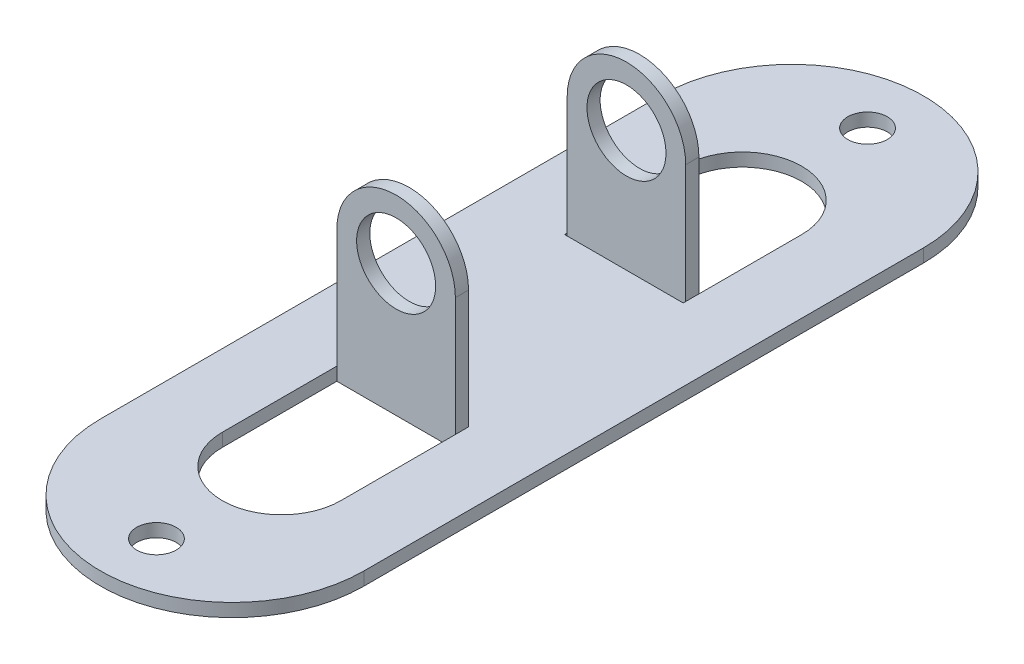
ISO-10303-21;
HEADER;
FILE_DESCRIPTION(('STEP AP214'),'2;1');
FILE_NAME('part.step','',(''),(''),'','','');
FILE_SCHEMA(('AUTOMOTIVE_DESIGN { 1 0 10303 214 1 1 1 1 }'));
ENDSEC;
DATA;
#1=APPLICATION_CONTEXT('core data for automotive mechanical design processes');
#2=APPLICATION_PROTOCOL_DEFINITION('international standard','automotive_design',2000,#1);
#3=PRODUCT_CONTEXT('',#1,'mechanical');
#4=PRODUCT('Part','Part','',(#3));
#5=PRODUCT_RELATED_PRODUCT_CATEGORY('part','',(#4));
#6=PRODUCT_DEFINITION_FORMATION('','',#4);
#7=PRODUCT_DEFINITION_CONTEXT('part definition',#1,'design');
#8=PRODUCT_DEFINITION('design','',#6,#7);
#9=PRODUCT_DEFINITION_SHAPE('','',#8);
#10=(LENGTH_UNIT() NAMED_UNIT(*) SI_UNIT(.MILLI.,.METRE.));
#11=(NAMED_UNIT(*) PLANE_ANGLE_UNIT() SI_UNIT($,.RADIAN.));
#12=(NAMED_UNIT(*) SI_UNIT($,.STERADIAN.) SOLID_ANGLE_UNIT());
#13=UNCERTAINTY_MEASURE_WITH_UNIT(LENGTH_MEASURE(1.E-05),#10,'distance_accuracy_value','');
#14=(GEOMETRIC_REPRESENTATION_CONTEXT(3) GLOBAL_UNCERTAINTY_ASSIGNED_CONTEXT((#13)) GLOBAL_UNIT_ASSIGNED_CONTEXT((#10,
#11,#12)) REPRESENTATION_CONTEXT('',''));
#15=CARTESIAN_POINT('',(0.,0.,0.));
#16=DIRECTION('',(0.,0.,1.));
#17=DIRECTION('',(1.,0.,0.));
#18=AXIS2_PLACEMENT_3D('',#15,#16,#17);
#19=CARTESIAN_POINT('',(9.,-10.,-1.59991843827286));
#20=DIRECTION('',(1.,0.,0.));
#21=DIRECTION('',(0.,0.,-1.));
#22=AXIS2_PLACEMENT_3D('',#19,#20,#21);
#23=PLANE('',#22);
#24=DIRECTION('',(0.,1.,0.));
#25=VECTOR('',#24,1.);
#26=CARTESIAN_POINT('',(9.,-2.,-3.985));
#27=LINE('',#26,#25);
#28=CARTESIAN_POINT('',(9.,-2.,-3.985));
#29=VERTEX_POINT('',#28);
#30=CARTESIAN_POINT('',(9.,0.,-3.985));
#31=VERTEX_POINT('',#30);
#32=EDGE_CURVE('E182',#29,#31,#27,.T.);
#33=ORIENTED_EDGE('',*,*,#32,.T.);
#34=DIRECTION('',(0.,0.,-1.));
#35=VECTOR('',#34,1.);
#36=CARTESIAN_POINT('',(9.,0.,-1.59991843827286));
#37=LINE('',#36,#35);
#38=CARTESIAN_POINT('',(9.,0.,-19.5999184382729));
#39=VERTEX_POINT('',#38);
#40=EDGE_CURVE('E359',#31,#39,#37,.T.);
#41=ORIENTED_EDGE('',*,*,#40,.T.);
#42=DIRECTION('',(0.,1.,0.));
#43=VECTOR('',#42,1.);
#44=CARTESIAN_POINT('',(9.,-10.,-19.5999184382729));
#45=LINE('',#44,#43);
#46=CARTESIAN_POINT('',(9.,-2.,-19.5999184382729));
#47=VERTEX_POINT('',#46);
#48=EDGE_CURVE('E205',#47,#39,#45,.T.);
#49=ORIENTED_EDGE('',*,*,#48,.F.);
#50=DIRECTION('',(0.,0.,-1.));
#51=VECTOR('',#50,1.);
#52=CARTESIAN_POINT('',(9.,-2.,-27.0999184382729));
#53=LINE('',#52,#51);
#54=EDGE_CURVE('E198',#29,#47,#53,.T.);
#55=ORIENTED_EDGE('',*,*,#54,.F.);
#56=EDGE_LOOP('',(#33,#41,#49,#55));
#57=FACE_BOUND('',#56,.T.);
#58=ADVANCED_FACE('F38',(#57),#23,.F.);
#59=CARTESIAN_POINT('',(-9.,-10.,-1.59991843827286));
#60=DIRECTION('',(-1.,0.,0.));
#61=DIRECTION('',(0.,0.,1.));
#62=AXIS2_PLACEMENT_3D('',#59,#60,#61);
#63=PLANE('',#62);
#64=DIRECTION('',(0.,1.,0.));
#65=VECTOR('',#64,1.);
#66=CARTESIAN_POINT('',(-9.,-10.,-3.985));
#67=LINE('',#66,#65);
#68=CARTESIAN_POINT('',(-9.,-2.,-3.985));
#69=VERTEX_POINT('',#68);
#70=CARTESIAN_POINT('',(-9.,0.,-3.985));
#71=VERTEX_POINT('',#70);
#72=EDGE_CURVE('E11',#69,#71,#67,.T.);
#73=ORIENTED_EDGE('',*,*,#72,.F.);
#74=DIRECTION('',(0.,0.,1.));
#75=VECTOR('',#74,1.);
#76=CARTESIAN_POINT('',(-9.,-2.,-27.0999184382729));
#77=LINE('',#76,#75);
#78=CARTESIAN_POINT('',(-9.,-2.,-19.5999184382729));
#79=VERTEX_POINT('',#78);
#80=EDGE_CURVE('E201',#79,#69,#77,.T.);
#81=ORIENTED_EDGE('',*,*,#80,.F.);
#82=DIRECTION('',(0.,1.,0.));
#83=VECTOR('',#82,1.);
#84=CARTESIAN_POINT('',(-9.,-10.,-19.5999184382729));
#85=LINE('',#84,#83);
#86=CARTESIAN_POINT('',(-9.,0.,-19.5999184382729));
#87=VERTEX_POINT('',#86);
#88=EDGE_CURVE('E279',#79,#87,#85,.T.);
#89=ORIENTED_EDGE('',*,*,#88,.T.);
#90=DIRECTION('',(0.,0.,1.));
#91=VECTOR('',#90,1.);
#92=CARTESIAN_POINT('',(-9.,0.,-1.59991843827286));
#93=LINE('',#92,#91);
#94=EDGE_CURVE('E271',#87,#71,#93,.T.);
#95=ORIENTED_EDGE('',*,*,#94,.T.);
#96=EDGE_LOOP('',(#73,#81,#89,#95));
#97=FACE_BOUND('',#96,.T.);
#98=ADVANCED_FACE('F364',(#97),#63,.F.);
#99=CARTESIAN_POINT('',(0.,0.,-27.0999184382729));
#100=DIRECTION('',(0.,1.,0.));
#101=DIRECTION('',(0.,0.,1.));
#102=AXIS2_PLACEMENT_3D('',#99,#100,#101);
#103=PLANE('',#102);
#104=CARTESIAN_POINT('',(0.,0.,-38.5999184382729));
#105=DIRECTION('',(0.,1.,0.));
#106=DIRECTION('',(0.,0.,1.));
#107=AXIS2_PLACEMENT_3D('',#104,#105,#106);
#108=CIRCLE('',#107,3.);
#109=CARTESIAN_POINT('',(0.,0.,-35.5999184382729));
#110=VERTEX_POINT('',#109);
#111=EDGE_CURVE('E387',#110,#110,#108,.T.);
#112=ORIENTED_EDGE('',*,*,#111,.F.);
#113=EDGE_LOOP('',(#112));
#114=FACE_BOUND('',#113,.T.);
#115=CARTESIAN_POINT('',(0.,0.,69.4000815617271));
#116=DIRECTION('',(0.,1.,0.));
#117=DIRECTION('',(0.,0.,1.));
#118=AXIS2_PLACEMENT_3D('',#115,#116,#117);
#119=CIRCLE('',#118,3.);
#120=CARTESIAN_POINT('',(0.,0.,72.4000815617271));
#121=VERTEX_POINT('',#120);
#122=EDGE_CURVE('E381',#121,#121,#119,.T.);
#123=ORIENTED_EDGE('',*,*,#122,.F.);
#124=EDGE_LOOP('',(#123));
#125=FACE_BOUND('',#124,.T.);
#126=CARTESIAN_POINT('',(9.,0.,-1.59991843827286));
#127=VERTEX_POINT('',#126);
#128=CARTESIAN_POINT('',(9.,0.,-1.985));
#129=VERTEX_POINT('',#128);
#130=EDGE_CURVE('E273',#127,#129,#37,.T.);
#131=ORIENTED_EDGE('',*,*,#130,.F.);
#132=DIRECTION('',(1.,0.,0.));
#133=VECTOR('',#132,1.);
#134=CARTESIAN_POINT('',(9.,0.,-1.59991843827286));
#135=LINE('',#134,#133);
#136=CARTESIAN_POINT('',(-9.,0.,-1.59991843827286));
#137=VERTEX_POINT('',#136);
#138=EDGE_CURVE('E268',#137,#127,#135,.T.);
#139=ORIENTED_EDGE('',*,*,#138,.F.);
#140=CARTESIAN_POINT('',(-9.,0.,-1.985));
#141=VERTEX_POINT('',#140);
#142=EDGE_CURVE('E255',#141,#137,#93,.T.);
#143=ORIENTED_EDGE('',*,*,#142,.F.);
#144=EDGE_CURVE('E265',#71,#141,#93,.T.);
#145=ORIENTED_EDGE('',*,*,#144,.F.);
#146=ORIENTED_EDGE('',*,*,#94,.F.);
#147=CARTESIAN_POINT('',(0.,0.,-19.5999184382729));
#148=DIRECTION('',(0.,1.,0.));
#149=DIRECTION('',(0.,0.,-1.));
#150=AXIS2_PLACEMENT_3D('',#147,#148,#149);
#151=CIRCLE('',#150,9.);
#152=EDGE_CURVE('E269',#39,#87,#151,.T.);
#153=ORIENTED_EDGE('',*,*,#152,.F.);
#154=ORIENTED_EDGE('',*,*,#40,.F.);
#155=EDGE_CURVE('E360',#129,#31,#37,.T.);
#156=ORIENTED_EDGE('',*,*,#155,.F.);
#157=EDGE_LOOP('',(#131,#139,#143,#145,#146,#153,#154,#156));
#158=FACE_BOUND('',#157,.T.);
#159=CARTESIAN_POINT('',(0.,0.,-27.0999184382729));
#160=DIRECTION('',(0.,1.,0.));
#161=DIRECTION('',(0.,0.,1.));
#162=AXIS2_PLACEMENT_3D('',#159,#160,#161);
#163=CIRCLE('',#162,20.);
#164=CARTESIAN_POINT('',(20.,0.,-27.0999184382729));
#165=VERTEX_POINT('',#164);
#166=CARTESIAN_POINT('',(-20.,0.,-27.0999184382729));
#167=VERTEX_POINT('',#166);
#168=EDGE_CURVE('E210',#165,#167,#163,.T.);
#169=ORIENTED_EDGE('',*,*,#168,.T.);
#170=DIRECTION('',(0.,0.,1.));
#171=VECTOR('',#170,1.);
#172=CARTESIAN_POINT('',(-20.,0.,-27.0999184382729));
#173=LINE('',#172,#171);
#174=CARTESIAN_POINT('',(-20.,0.,57.9000815617271));
#175=VERTEX_POINT('',#174);
#176=EDGE_CURVE('E231',#167,#175,#173,.T.);
#177=ORIENTED_EDGE('',*,*,#176,.T.);
#178=CARTESIAN_POINT('',(0.,0.,57.9000815617271));
#179=DIRECTION('',(0.,1.,0.));
#180=DIRECTION('',(0.,0.,1.));
#181=AXIS2_PLACEMENT_3D('',#178,#179,#180);
#182=CIRCLE('',#181,20.);
#183=CARTESIAN_POINT('',(20.,0.,57.9000815617271));
#184=VERTEX_POINT('',#183);
#185=EDGE_CURVE('E234',#175,#184,#182,.T.);
#186=ORIENTED_EDGE('',*,*,#185,.T.);
#187=DIRECTION('',(0.,0.,-1.));
#188=VECTOR('',#187,1.);
#189=CARTESIAN_POINT('',(20.,0.,-27.0999184382729));
#190=LINE('',#189,#188);
#191=EDGE_CURVE('E219',#184,#165,#190,.T.);
#192=ORIENTED_EDGE('',*,*,#191,.T.);
#193=EDGE_LOOP('',(#169,#177,#186,#192));
#194=FACE_BOUND('',#193,.T.);
#195=DIRECTION('',(1.,0.,0.));
#196=VECTOR('',#195,1.);
#197=CARTESIAN_POINT('',(0.,0.,31.));
#198=LINE('',#197,#196);
#199=CARTESIAN_POINT('',(-8.99999999999999,0.,31.));
#200=VERTEX_POINT('',#199);
#201=CARTESIAN_POINT('',(9.00000000000001,0.,31.));
#202=VERTEX_POINT('',#201);
#203=EDGE_CURVE('E241',#200,#202,#198,.T.);
#204=ORIENTED_EDGE('',*,*,#203,.T.);
#205=DIRECTION('',(0.,0.,-1.));
#206=VECTOR('',#205,1.);
#207=CARTESIAN_POINT('',(9.00000000000001,0.,32.4000815617271));
#208=LINE('',#207,#206);
#209=CARTESIAN_POINT('',(9.00000000000001,0.,33.));
#210=VERTEX_POINT('',#209);
#211=EDGE_CURVE('E342',#210,#202,#208,.T.);
#212=ORIENTED_EDGE('',*,*,#211,.F.);
#213=CARTESIAN_POINT('',(9.00000000000001,0.,50.4000815617271));
#214=VERTEX_POINT('',#213);
#215=EDGE_CURVE('E343',#214,#210,#208,.T.);
#216=ORIENTED_EDGE('',*,*,#215,.F.);
#217=CARTESIAN_POINT('',(0.,0.,50.4000815617271));
#218=DIRECTION('',(0.,1.,0.));
#219=DIRECTION('',(0.,0.,-1.));
#220=AXIS2_PLACEMENT_3D('',#217,#218,#219);
#221=CIRCLE('',#220,9.);
#222=CARTESIAN_POINT('',(-8.99999999999999,0.,50.4000815617271));
#223=VERTEX_POINT('',#222);
#224=EDGE_CURVE('E339',#223,#214,#221,.T.);
#225=ORIENTED_EDGE('',*,*,#224,.F.);
#226=DIRECTION('',(0.,0.,1.));
#227=VECTOR('',#226,1.);
#228=CARTESIAN_POINT('',(-8.99999999999999,0.,32.4000815617271));
#229=LINE('',#228,#227);
#230=CARTESIAN_POINT('',(-8.99999999999999,0.,33.));
#231=VERTEX_POINT('',#230);
#232=EDGE_CURVE('E336',#231,#223,#229,.T.);
#233=ORIENTED_EDGE('',*,*,#232,.F.);
#234=EDGE_CURVE('E337',#200,#231,#229,.T.);
#235=ORIENTED_EDGE('',*,*,#234,.F.);
#236=EDGE_LOOP('',(#204,#212,#216,#225,#233,#235));
#237=FACE_BOUND('',#236,.T.);
#238=ADVANCED_FACE('F262',(#114,#125,#158,#194,#237),#103,.T.);
#239=CARTESIAN_POINT('',(0.,-2.,-27.0999184382729));
#240=DIRECTION('',(0.,1.,0.));
#241=DIRECTION('',(0.,0.,1.));
#242=AXIS2_PLACEMENT_3D('',#239,#240,#241);
#243=CYLINDRICAL_SURFACE('',#242,20.);
#244=ORIENTED_EDGE('',*,*,#168,.F.);
#245=DIRECTION('',(0.,1.,0.));
#246=VECTOR('',#245,1.);
#247=CARTESIAN_POINT('',(20.,-2.,-27.0999184382729));
#248=LINE('',#247,#246);
#249=CARTESIAN_POINT('',(20.,-2.,-27.0999184382729));
#250=VERTEX_POINT('',#249);
#251=EDGE_CURVE('E239',#250,#165,#248,.T.);
#252=ORIENTED_EDGE('',*,*,#251,.F.);
#253=CARTESIAN_POINT('',(0.,-2.,-27.0999184382729));
#254=DIRECTION('',(0.,1.,0.));
#255=DIRECTION('',(0.,0.,1.));
#256=AXIS2_PLACEMENT_3D('',#253,#254,#255);
#257=CIRCLE('',#256,20.);
#258=CARTESIAN_POINT('',(-20.,-2.,-27.0999184382729));
#259=VERTEX_POINT('',#258);
#260=EDGE_CURVE('E215',#250,#259,#257,.T.);
#261=ORIENTED_EDGE('',*,*,#260,.T.);
#262=DIRECTION('',(0.,1.,0.));
#263=VECTOR('',#262,1.);
#264=CARTESIAN_POINT('',(-20.,-2.,-27.0999184382729));
#265=LINE('',#264,#263);
#266=EDGE_CURVE('E228',#259,#167,#265,.T.);
#267=ORIENTED_EDGE('',*,*,#266,.T.);
#268=EDGE_LOOP('',(#244,#252,#261,#267));
#269=FACE_BOUND('',#268,.T.);
#270=ADVANCED_FACE('F40',(#269),#243,.T.);
#271=CARTESIAN_POINT('',(20.,-2.,-27.0999184382729));
#272=DIRECTION('',(1.,0.,0.));
#273=DIRECTION('',(0.,0.,-1.));
#274=AXIS2_PLACEMENT_3D('',#271,#272,#273);
#275=PLANE('',#274);
#276=ORIENTED_EDGE('',*,*,#191,.F.);
#277=DIRECTION('',(0.,1.,0.));
#278=VECTOR('',#277,1.);
#279=CARTESIAN_POINT('',(20.,-2.,57.9000815617271));
#280=LINE('',#279,#278);
#281=CARTESIAN_POINT('',(20.,-2.,57.9000815617271));
#282=VERTEX_POINT('',#281);
#283=EDGE_CURVE('E242',#282,#184,#280,.T.);
#284=ORIENTED_EDGE('',*,*,#283,.F.);
#285=DIRECTION('',(0.,0.,-1.));
#286=VECTOR('',#285,1.);
#287=CARTESIAN_POINT('',(20.,-2.,-27.0999184382729));
#288=LINE('',#287,#286);
#289=EDGE_CURVE('E225',#282,#250,#288,.T.);
#290=ORIENTED_EDGE('',*,*,#289,.T.);
#291=ORIENTED_EDGE('',*,*,#251,.T.);
#292=EDGE_LOOP('',(#276,#284,#290,#291));
#293=FACE_BOUND('',#292,.T.);
#294=ADVANCED_FACE('F648',(#293),#275,.T.);
#295=CARTESIAN_POINT('',(0.,-2.,57.9000815617271));
#296=DIRECTION('',(0.,1.,0.));
#297=DIRECTION('',(0.,0.,1.));
#298=AXIS2_PLACEMENT_3D('',#295,#296,#297);
#299=CYLINDRICAL_SURFACE('',#298,20.);
#300=ORIENTED_EDGE('',*,*,#185,.F.);
#301=DIRECTION('',(0.,1.,0.));
#302=VECTOR('',#301,1.);
#303=CARTESIAN_POINT('',(-20.,-2.,57.9000815617271));
#304=LINE('',#303,#302);
#305=CARTESIAN_POINT('',(-20.,-2.,57.9000815617271));
#306=VERTEX_POINT('',#305);
#307=EDGE_CURVE('E244',#306,#175,#304,.T.);
#308=ORIENTED_EDGE('',*,*,#307,.F.);
#309=CARTESIAN_POINT('',(0.,-2.,57.9000815617271));
#310=DIRECTION('',(0.,1.,0.));
#311=DIRECTION('',(0.,0.,1.));
#312=AXIS2_PLACEMENT_3D('',#309,#310,#311);
#313=CIRCLE('',#312,20.);
#314=EDGE_CURVE('E222',#306,#282,#313,.T.);
#315=ORIENTED_EDGE('',*,*,#314,.T.);
#316=ORIENTED_EDGE('',*,*,#283,.T.);
#317=EDGE_LOOP('',(#300,#308,#315,#316));
#318=FACE_BOUND('',#317,.T.);
#319=ADVANCED_FACE('F641',(#318),#299,.T.);
#320=CARTESIAN_POINT('',(-20.,-2.,-27.0999184382729));
#321=DIRECTION('',(-1.,0.,0.));
#322=DIRECTION('',(0.,0.,1.));
#323=AXIS2_PLACEMENT_3D('',#320,#321,#322);
#324=PLANE('',#323);
#325=ORIENTED_EDGE('',*,*,#176,.F.);
#326=ORIENTED_EDGE('',*,*,#266,.F.);
#327=DIRECTION('',(0.,0.,1.));
#328=VECTOR('',#327,1.);
#329=CARTESIAN_POINT('',(-20.,-2.,-27.0999184382729));
#330=LINE('',#329,#328);
#331=EDGE_CURVE('E218',#259,#306,#330,.T.);
#332=ORIENTED_EDGE('',*,*,#331,.T.);
#333=ORIENTED_EDGE('',*,*,#307,.T.);
#334=EDGE_LOOP('',(#325,#326,#332,#333));
#335=FACE_BOUND('',#334,.T.);
#336=ADVANCED_FACE('F398',(#335),#324,.T.);
#337=CARTESIAN_POINT('',(0.,-2.,-27.0999184382729));
#338=DIRECTION('',(0.,1.,0.));
#339=DIRECTION('',(0.,0.,1.));
#340=AXIS2_PLACEMENT_3D('',#337,#338,#339);
#341=PLANE('',#340);
#342=CARTESIAN_POINT('',(0.,-2.,-38.5999184382729));
#343=DIRECTION('',(0.,-1.,0.));
#344=DIRECTION('',(0.,0.,-1.));
#345=AXIS2_PLACEMENT_3D('',#342,#343,#344);
#346=CIRCLE('',#345,3.);
#347=CARTESIAN_POINT('',(0.,-2.,-41.5999184382729));
#348=VERTEX_POINT('',#347);
#349=EDGE_CURVE('E390',#348,#348,#346,.T.);
#350=ORIENTED_EDGE('',*,*,#349,.F.);
#351=EDGE_LOOP('',(#350));
#352=FACE_BOUND('',#351,.T.);
#353=CARTESIAN_POINT('',(0.,-2.,69.4000815617271));
#354=DIRECTION('',(0.,-1.,0.));
#355=DIRECTION('',(0.,0.,-1.));
#356=AXIS2_PLACEMENT_3D('',#353,#354,#355);
#357=CIRCLE('',#356,3.);
#358=CARTESIAN_POINT('',(0.,-2.,66.4000815617271));
#359=VERTEX_POINT('',#358);
#360=EDGE_CURVE('E384',#359,#359,#357,.T.);
#361=ORIENTED_EDGE('',*,*,#360,.F.);
#362=EDGE_LOOP('',(#361));
#363=FACE_BOUND('',#362,.T.);
#364=CARTESIAN_POINT('',(9.,-2.,-1.59991843827286));
#365=VERTEX_POINT('',#364);
#366=CARTESIAN_POINT('',(9.,-2.,-1.985));
#367=VERTEX_POINT('',#366);
#368=EDGE_CURVE('E206',#365,#367,#53,.T.);
#369=ORIENTED_EDGE('',*,*,#368,.T.);
#370=DIRECTION('',(1.,0.,0.));
#371=VECTOR('',#370,1.);
#372=CARTESIAN_POINT('',(9.,-2.,-1.985));
#373=LINE('',#372,#371);
#374=CARTESIAN_POINT('',(-9.,-2.,-1.985));
#375=VERTEX_POINT('',#374);
#376=EDGE_CURVE('E54',#375,#367,#373,.T.);
#377=ORIENTED_EDGE('',*,*,#376,.F.);
#378=CARTESIAN_POINT('',(-9.,-2.,-1.59991843827286));
#379=VERTEX_POINT('',#378);
#380=EDGE_CURVE('E257',#375,#379,#77,.T.);
#381=ORIENTED_EDGE('',*,*,#380,.T.);
#382=DIRECTION('',(1.,0.,0.));
#383=VECTOR('',#382,1.);
#384=CARTESIAN_POINT('',(0.,-2.,-1.59991843827286));
#385=LINE('',#384,#383);
#386=EDGE_CURVE('E207',#379,#365,#385,.T.);
#387=ORIENTED_EDGE('',*,*,#386,.T.);
#388=EDGE_LOOP('',(#369,#377,#381,#387));
#389=FACE_BOUND('',#388,.T.);
#390=DIRECTION('',(1.,0.,0.));
#391=VECTOR('',#390,1.);
#392=CARTESIAN_POINT('',(-8.99999999999999,-2.,33.));
#393=LINE('',#392,#391);
#394=CARTESIAN_POINT('',(-8.99999999999999,-2.,33.));
#395=VERTEX_POINT('',#394);
#396=CARTESIAN_POINT('',(9.00000000000001,-2.,33.));
#397=VERTEX_POINT('',#396);
#398=EDGE_CURVE('E312',#395,#397,#393,.T.);
#399=ORIENTED_EDGE('',*,*,#398,.F.);
#400=DIRECTION('',(0.,0.,1.));
#401=VECTOR('',#400,1.);
#402=CARTESIAN_POINT('',(-8.99999999999999,-2.,-27.0999184382729));
#403=LINE('',#402,#401);
#404=CARTESIAN_POINT('',(-8.99999999999999,-2.,50.4000815617271));
#405=VERTEX_POINT('',#404);
#406=EDGE_CURVE('E357',#395,#405,#403,.T.);
#407=ORIENTED_EDGE('',*,*,#406,.T.);
#408=CARTESIAN_POINT('',(0.,-2.,50.4000815617271));
#409=DIRECTION('',(0.,1.,0.));
#410=DIRECTION('',(0.,0.,1.));
#411=AXIS2_PLACEMENT_3D('',#408,#409,#410);
#412=CIRCLE('',#411,9.);
#413=CARTESIAN_POINT('',(9.00000000000001,-2.,50.4000815617271));
#414=VERTEX_POINT('',#413);
#415=EDGE_CURVE('E349',#405,#414,#412,.T.);
#416=ORIENTED_EDGE('',*,*,#415,.T.);
#417=DIRECTION('',(0.,0.,-1.));
#418=VECTOR('',#417,1.);
#419=CARTESIAN_POINT('',(9.00000000000001,-2.,-27.0999184382729));
#420=LINE('',#419,#418);
#421=EDGE_CURVE('E354',#414,#397,#420,.T.);
#422=ORIENTED_EDGE('',*,*,#421,.T.);
#423=EDGE_LOOP('',(#399,#407,#416,#422));
#424=FACE_BOUND('',#423,.T.);
#425=ORIENTED_EDGE('',*,*,#260,.F.);
#426=ORIENTED_EDGE('',*,*,#289,.F.);
#427=ORIENTED_EDGE('',*,*,#314,.F.);
#428=ORIENTED_EDGE('',*,*,#331,.F.);
#429=EDGE_LOOP('',(#425,#426,#427,#428));
#430=FACE_BOUND('',#429,.T.);
#431=DIRECTION('',(1.,0.,0.));
#432=VECTOR('',#431,1.);
#433=CARTESIAN_POINT('',(9.,-2.,-3.985));
#434=LINE('',#433,#432);
#435=EDGE_CURVE('E185',#69,#29,#434,.T.);
#436=ORIENTED_EDGE('',*,*,#435,.T.);
#437=ORIENTED_EDGE('',*,*,#54,.T.);
#438=CARTESIAN_POINT('',(0.,-2.,-19.5999184382729));
#439=DIRECTION('',(0.,1.,0.));
#440=DIRECTION('',(0.,0.,1.));
#441=AXIS2_PLACEMENT_3D('',#438,#439,#440);
#442=CIRCLE('',#441,9.);
#443=EDGE_CURVE('E284',#47,#79,#442,.T.);
#444=ORIENTED_EDGE('',*,*,#443,.T.);
#445=ORIENTED_EDGE('',*,*,#80,.T.);
#446=EDGE_LOOP('',(#436,#437,#444,#445));
#447=FACE_BOUND('',#446,.T.);
#448=ADVANCED_FACE('F196',(#352,#363,#389,#424,#430,#447),#341,.F.);
#449=ORIENTED_EDGE('',*,*,#130,.T.);
#450=DIRECTION('',(0.,1.,0.));
#451=VECTOR('',#450,1.);
#452=CARTESIAN_POINT('',(9.,-2.,-1.985));
#453=LINE('',#452,#451);
#454=EDGE_CURVE('E295',#367,#129,#453,.T.);
#455=ORIENTED_EDGE('',*,*,#454,.F.);
#456=ORIENTED_EDGE('',*,*,#368,.F.);
#457=DIRECTION('',(0.,1.,0.));
#458=VECTOR('',#457,1.);
#459=CARTESIAN_POINT('',(9.,-10.,-1.59991843827286));
#460=LINE('',#459,#458);
#461=EDGE_CURVE('E282',#365,#127,#460,.T.);
#462=ORIENTED_EDGE('',*,*,#461,.T.);
#463=EDGE_LOOP('',(#449,#455,#456,#462));
#464=FACE_BOUND('',#463,.T.);
#465=ADVANCED_FACE('F294',(#464),#23,.F.);
#466=CARTESIAN_POINT('',(9.,-10.,-1.59991843827286));
#467=DIRECTION('',(0.,0.,1.));
#468=DIRECTION('',(1.,0.,0.));
#469=AXIS2_PLACEMENT_3D('',#466,#467,#468);
#470=PLANE('',#469);
#471=DIRECTION('',(0.,1.,0.));
#472=VECTOR('',#471,1.);
#473=CARTESIAN_POINT('',(-9.,-10.,-1.59991843827286));
#474=LINE('',#473,#472);
#475=EDGE_CURVE('E285',#379,#137,#474,.T.);
#476=ORIENTED_EDGE('',*,*,#475,.T.);
#477=ORIENTED_EDGE('',*,*,#138,.T.);
#478=ORIENTED_EDGE('',*,*,#461,.F.);
#479=ORIENTED_EDGE('',*,*,#386,.F.);
#480=EDGE_LOOP('',(#476,#477,#478,#479));
#481=FACE_BOUND('',#480,.T.);
#482=ADVANCED_FACE('F291',(#481),#470,.F.);
#483=ORIENTED_EDGE('',*,*,#380,.F.);
#484=DIRECTION('',(0.,1.,0.));
#485=VECTOR('',#484,1.);
#486=CARTESIAN_POINT('',(-9.,-10.,-1.985));
#487=LINE('',#486,#485);
#488=EDGE_CURVE('E47',#375,#141,#487,.T.);
#489=ORIENTED_EDGE('',*,*,#488,.T.);
#490=ORIENTED_EDGE('',*,*,#142,.T.);
#491=ORIENTED_EDGE('',*,*,#475,.F.);
#492=EDGE_LOOP('',(#483,#489,#490,#491));
#493=FACE_BOUND('',#492,.T.);
#494=ADVANCED_FACE('F253',(#493),#63,.F.);
#495=CARTESIAN_POINT('',(0.,-10.,-19.5999184382729));
#496=DIRECTION('',(0.,1.,0.));
#497=DIRECTION('',(0.,0.,1.));
#498=AXIS2_PLACEMENT_3D('',#495,#496,#497);
#499=CYLINDRICAL_SURFACE('',#498,9.);
#500=ORIENTED_EDGE('',*,*,#48,.T.);
#501=ORIENTED_EDGE('',*,*,#152,.T.);
#502=ORIENTED_EDGE('',*,*,#88,.F.);
#503=ORIENTED_EDGE('',*,*,#443,.F.);
#504=EDGE_LOOP('',(#500,#501,#502,#503));
#505=FACE_BOUND('',#504,.T.);
#506=ADVANCED_FACE('F363',(#505),#499,.F.);
#507=CARTESIAN_POINT('',(-8.99999999999999,-10.,32.4000815617271));
#508=DIRECTION('',(-1.,0.,0.));
#509=DIRECTION('',(0.,0.,1.));
#510=AXIS2_PLACEMENT_3D('',#507,#508,#509);
#511=PLANE('',#510);
#512=ORIENTED_EDGE('',*,*,#406,.F.);
#513=DIRECTION('',(0.,-1.,0.));
#514=VECTOR('',#513,1.);
#515=CARTESIAN_POINT('',(-8.99999999999999,-2.,33.));
#516=LINE('',#515,#514);
#517=EDGE_CURVE('E321',#231,#395,#516,.T.);
#518=ORIENTED_EDGE('',*,*,#517,.F.);
#519=ORIENTED_EDGE('',*,*,#232,.T.);
#520=DIRECTION('',(0.,1.,0.));
#521=VECTOR('',#520,1.);
#522=CARTESIAN_POINT('',(-8.99999999999999,-10.,50.4000815617271));
#523=LINE('',#522,#521);
#524=EDGE_CURVE('E346',#405,#223,#523,.T.);
#525=ORIENTED_EDGE('',*,*,#524,.F.);
#526=EDGE_LOOP('',(#512,#518,#519,#525));
#527=FACE_BOUND('',#526,.T.);
#528=ADVANCED_FACE('F432',(#527),#511,.F.);
#529=CARTESIAN_POINT('',(9.00000000000001,-10.,32.4000815617271));
#530=DIRECTION('',(1.,0.,0.));
#531=DIRECTION('',(0.,0.,-1.));
#532=AXIS2_PLACEMENT_3D('',#529,#530,#531);
#533=PLANE('',#532);
#534=ORIENTED_EDGE('',*,*,#215,.T.);
#535=DIRECTION('',(0.,1.,0.));
#536=VECTOR('',#535,1.);
#537=CARTESIAN_POINT('',(9.00000000000001,-2.,33.));
#538=LINE('',#537,#536);
#539=EDGE_CURVE('E316',#397,#210,#538,.T.);
#540=ORIENTED_EDGE('',*,*,#539,.F.);
#541=ORIENTED_EDGE('',*,*,#421,.F.);
#542=DIRECTION('',(0.,1.,0.));
#543=VECTOR('',#542,1.);
#544=CARTESIAN_POINT('',(9.00000000000001,-10.,50.4000815617271));
#545=LINE('',#544,#543);
#546=EDGE_CURVE('E347',#414,#214,#545,.T.);
#547=ORIENTED_EDGE('',*,*,#546,.T.);
#548=EDGE_LOOP('',(#534,#540,#541,#547));
#549=FACE_BOUND('',#548,.T.);
#550=ADVANCED_FACE('F438',(#549),#533,.F.);
#551=CARTESIAN_POINT('',(0.,-10.,50.4000815617271));
#552=DIRECTION('',(0.,1.,0.));
#553=DIRECTION('',(0.,0.,1.));
#554=AXIS2_PLACEMENT_3D('',#551,#552,#553);
#555=CYLINDRICAL_SURFACE('',#554,9.);
#556=ORIENTED_EDGE('',*,*,#524,.T.);
#557=ORIENTED_EDGE('',*,*,#224,.T.);
#558=ORIENTED_EDGE('',*,*,#546,.F.);
#559=ORIENTED_EDGE('',*,*,#415,.F.);
#560=EDGE_LOOP('',(#556,#557,#558,#559));
#561=FACE_BOUND('',#560,.T.);
#562=ADVANCED_FACE('F443',(#561),#555,.F.);
#563=CARTESIAN_POINT('',(9.00000000000001,-2.,33.));
#564=DIRECTION('',(-1.,0.,0.));
#565=DIRECTION('',(0.,0.,1.));
#566=AXIS2_PLACEMENT_3D('',#563,#564,#565);
#567=PLANE('',#566);
#568=ORIENTED_EDGE('',*,*,#211,.T.);
#569=DIRECTION('',(0.,1.,0.));
#570=VECTOR('',#569,1.);
#571=CARTESIAN_POINT('',(9.00000000000001,-2.,31.));
#572=LINE('',#571,#570);
#573=CARTESIAN_POINT('',(9.00000000000001,18.,31.));
#574=VERTEX_POINT('',#573);
#575=EDGE_CURVE('E307',#202,#574,#572,.T.);
#576=ORIENTED_EDGE('',*,*,#575,.T.);
#577=DIRECTION('',(0.,0.,-1.));
#578=VECTOR('',#577,1.);
#579=CARTESIAN_POINT('',(9.00000000000001,18.,33.));
#580=LINE('',#579,#578);
#581=CARTESIAN_POINT('',(9.00000000000001,18.,33.));
#582=VERTEX_POINT('',#581);
#583=EDGE_CURVE('E333',#582,#574,#580,.T.);
#584=ORIENTED_EDGE('',*,*,#583,.F.);
#585=EDGE_CURVE('E314',#210,#582,#538,.T.);
#586=ORIENTED_EDGE('',*,*,#585,.F.);
#587=EDGE_LOOP('',(#568,#576,#584,#586));
#588=FACE_BOUND('',#587,.T.);
#589=ADVANCED_FACE('F466',(#588),#567,.F.);
#590=CARTESIAN_POINT('',(0.,18.,33.));
#591=DIRECTION('',(0.,0.,-1.));
#592=DIRECTION('',(-1.,0.,0.));
#593=AXIS2_PLACEMENT_3D('',#590,#591,#592);
#594=CYLINDRICAL_SURFACE('',#593,9.);
#595=CARTESIAN_POINT('',(0.,18.,31.));
#596=DIRECTION('',(0.,0.,1.));
#597=DIRECTION('',(1.,0.,0.));
#598=AXIS2_PLACEMENT_3D('',#595,#596,#597);
#599=CIRCLE('',#598,9.);
#600=CARTESIAN_POINT('',(-8.99999999999999,18.,31.));
#601=VERTEX_POINT('',#600);
#602=EDGE_CURVE('E327',#574,#601,#599,.T.);
#603=ORIENTED_EDGE('',*,*,#602,.T.);
#604=DIRECTION('',(0.,0.,-1.));
#605=VECTOR('',#604,1.);
#606=CARTESIAN_POINT('',(-8.99999999999999,18.,33.));
#607=LINE('',#606,#605);
#608=CARTESIAN_POINT('',(-8.99999999999999,18.,33.));
#609=VERTEX_POINT('',#608);
#610=EDGE_CURVE('E325',#609,#601,#607,.T.);
#611=ORIENTED_EDGE('',*,*,#610,.F.);
#612=CARTESIAN_POINT('',(0.,18.,33.));
#613=DIRECTION('',(0.,0.,1.));
#614=DIRECTION('',(1.,0.,0.));
#615=AXIS2_PLACEMENT_3D('',#612,#613,#614);
#616=CIRCLE('',#615,9.);
#617=EDGE_CURVE('E319',#582,#609,#616,.T.);
#618=ORIENTED_EDGE('',*,*,#617,.F.);
#619=ORIENTED_EDGE('',*,*,#583,.T.);
#620=EDGE_LOOP('',(#603,#611,#618,#619));
#621=FACE_BOUND('',#620,.T.);
#622=ADVANCED_FACE('F473',(#621),#594,.T.);
#623=CARTESIAN_POINT('',(-8.99999999999999,-2.,33.));
#624=DIRECTION('',(1.,0.,0.));
#625=DIRECTION('',(0.,0.,-1.));
#626=AXIS2_PLACEMENT_3D('',#623,#624,#625);
#627=PLANE('',#626);
#628=ORIENTED_EDGE('',*,*,#234,.T.);
#629=EDGE_CURVE('E322',#609,#231,#516,.T.);
#630=ORIENTED_EDGE('',*,*,#629,.F.);
#631=ORIENTED_EDGE('',*,*,#610,.T.);
#632=DIRECTION('',(0.,-1.,0.));
#633=VECTOR('',#632,1.);
#634=CARTESIAN_POINT('',(-8.99999999999999,-2.,31.));
#635=LINE('',#634,#633);
#636=EDGE_CURVE('E315',#601,#200,#635,.T.);
#637=ORIENTED_EDGE('',*,*,#636,.T.);
#638=EDGE_LOOP('',(#628,#630,#631,#637));
#639=FACE_BOUND('',#638,.T.);
#640=ADVANCED_FACE('F477',(#639),#627,.F.);
#641=CARTESIAN_POINT('',(0.,18.,33.));
#642=DIRECTION('',(0.,0.,1.));
#643=DIRECTION('',(1.,0.,0.));
#644=AXIS2_PLACEMENT_3D('',#641,#642,#643);
#645=PLANE('',#644);
#646=CARTESIAN_POINT('',(0.,18.,33.));
#647=DIRECTION('',(0.,0.,1.));
#648=DIRECTION('',(1.,0.,0.));
#649=AXIS2_PLACEMENT_3D('',#646,#647,#648);
#650=CIRCLE('',#649,6.);
#651=CARTESIAN_POINT('',(6.00000000000001,18.,33.));
#652=VERTEX_POINT('',#651);
#653=EDGE_CURVE('E378',#652,#652,#650,.T.);
#654=ORIENTED_EDGE('',*,*,#653,.F.);
#655=EDGE_LOOP('',(#654));
#656=FACE_BOUND('',#655,.T.);
#657=ORIENTED_EDGE('',*,*,#398,.T.);
#658=ORIENTED_EDGE('',*,*,#539,.T.);
#659=ORIENTED_EDGE('',*,*,#585,.T.);
#660=ORIENTED_EDGE('',*,*,#617,.T.);
#661=ORIENTED_EDGE('',*,*,#629,.T.);
#662=ORIENTED_EDGE('',*,*,#517,.T.);
#663=EDGE_LOOP('',(#657,#658,#659,#660,#661,#662));
#664=FACE_BOUND('',#663,.T.);
#665=ADVANCED_FACE('F460',(#656,#664),#645,.T.);
#666=CARTESIAN_POINT('',(0.,18.,31.));
#667=DIRECTION('',(0.,0.,1.));
#668=DIRECTION('',(1.,0.,0.));
#669=AXIS2_PLACEMENT_3D('',#666,#667,#668);
#670=PLANE('',#669);
#671=CARTESIAN_POINT('',(0.,18.,31.));
#672=DIRECTION('',(0.,0.,1.));
#673=DIRECTION('',(1.,0.,0.));
#674=AXIS2_PLACEMENT_3D('',#671,#672,#673);
#675=CIRCLE('',#674,6.);
#676=CARTESIAN_POINT('',(6.00000000000001,18.,31.));
#677=VERTEX_POINT('',#676);
#678=EDGE_CURVE('E372',#677,#677,#675,.T.);
#679=ORIENTED_EDGE('',*,*,#678,.T.);
#680=EDGE_LOOP('',(#679));
#681=FACE_BOUND('',#680,.T.);
#682=ORIENTED_EDGE('',*,*,#203,.F.);
#683=ORIENTED_EDGE('',*,*,#636,.F.);
#684=ORIENTED_EDGE('',*,*,#602,.F.);
#685=ORIENTED_EDGE('',*,*,#575,.F.);
#686=EDGE_LOOP('',(#682,#683,#684,#685));
#687=FACE_BOUND('',#686,.T.);
#688=ADVANCED_FACE('F469',(#681,#687),#670,.F.);
#689=CARTESIAN_POINT('',(-9.,-2.,-3.985));
#690=DIRECTION('',(-1.,0.,0.));
#691=DIRECTION('',(0.,0.,1.));
#692=AXIS2_PLACEMENT_3D('',#689,#690,#691);
#693=PLANE('',#692);
#694=DIRECTION('',(0.,-1.,0.));
#695=VECTOR('',#694,1.);
#696=CARTESIAN_POINT('',(-9.,-2.,-3.985));
#697=LINE('',#696,#695);
#698=CARTESIAN_POINT('',(-9.,18.,-3.985));
#699=VERTEX_POINT('',#698);
#700=EDGE_CURVE('E311',#699,#71,#697,.T.);
#701=ORIENTED_EDGE('',*,*,#700,.T.);
#702=ORIENTED_EDGE('',*,*,#144,.T.);
#703=DIRECTION('',(0.,-1.,0.));
#704=VECTOR('',#703,1.);
#705=CARTESIAN_POINT('',(-9.,-2.,-1.985));
#706=LINE('',#705,#704);
#707=CARTESIAN_POINT('',(-9.,18.,-1.985));
#708=VERTEX_POINT('',#707);
#709=EDGE_CURVE('E60',#708,#141,#706,.T.);
#710=ORIENTED_EDGE('',*,*,#709,.F.);
#711=DIRECTION('',(0.,0.,1.));
#712=VECTOR('',#711,1.);
#713=CARTESIAN_POINT('',(-9.,18.,-3.985));
#714=LINE('',#713,#712);
#715=EDGE_CURVE('E305',#699,#708,#714,.T.);
#716=ORIENTED_EDGE('',*,*,#715,.F.);
#717=EDGE_LOOP('',(#701,#702,#710,#716));
#718=FACE_BOUND('',#717,.T.);
#719=ADVANCED_FACE('F368',(#718),#693,.T.);
#720=CARTESIAN_POINT('',(0.,18.,-3.985));
#721=DIRECTION('',(0.,0.,1.));
#722=DIRECTION('',(1.,0.,0.));
#723=AXIS2_PLACEMENT_3D('',#720,#721,#722);
#724=CYLINDRICAL_SURFACE('',#723,9.);
#725=CARTESIAN_POINT('',(0.,18.,-1.985));
#726=DIRECTION('',(0.,0.,1.));
#727=DIRECTION('',(1.,0.,0.));
#728=AXIS2_PLACEMENT_3D('',#725,#726,#727);
#729=CIRCLE('',#728,9.);
#730=CARTESIAN_POINT('',(9.,18.,-1.985));
#731=VERTEX_POINT('',#730);
#732=EDGE_CURVE('E297',#731,#708,#729,.T.);
#733=ORIENTED_EDGE('',*,*,#732,.F.);
#734=DIRECTION('',(0.,0.,1.));
#735=VECTOR('',#734,1.);
#736=CARTESIAN_POINT('',(9.,18.,-3.985));
#737=LINE('',#736,#735);
#738=CARTESIAN_POINT('',(9.,18.,-3.985));
#739=VERTEX_POINT('',#738);
#740=EDGE_CURVE('E308',#739,#731,#737,.T.);
#741=ORIENTED_EDGE('',*,*,#740,.F.);
#742=CARTESIAN_POINT('',(0.,18.,-3.985));
#743=DIRECTION('',(0.,0.,1.));
#744=DIRECTION('',(1.,0.,0.));
#745=AXIS2_PLACEMENT_3D('',#742,#743,#744);
#746=CIRCLE('',#745,9.);
#747=EDGE_CURVE('E192',#739,#699,#746,.T.);
#748=ORIENTED_EDGE('',*,*,#747,.T.);
#749=ORIENTED_EDGE('',*,*,#715,.T.);
#750=EDGE_LOOP('',(#733,#741,#748,#749));
#751=FACE_BOUND('',#750,.T.);
#752=ADVANCED_FACE('F543',(#751),#724,.T.);
#753=CARTESIAN_POINT('',(9.,-2.,-3.985));
#754=DIRECTION('',(1.,0.,0.));
#755=DIRECTION('',(0.,0.,-1.));
#756=AXIS2_PLACEMENT_3D('',#753,#754,#755);
#757=PLANE('',#756);
#758=EDGE_CURVE('E298',#129,#731,#453,.T.);
#759=ORIENTED_EDGE('',*,*,#758,.F.);
#760=ORIENTED_EDGE('',*,*,#155,.T.);
#761=EDGE_CURVE('E188',#31,#739,#27,.T.);
#762=ORIENTED_EDGE('',*,*,#761,.T.);
#763=ORIENTED_EDGE('',*,*,#740,.T.);
#764=EDGE_LOOP('',(#759,#760,#762,#763));
#765=FACE_BOUND('',#764,.T.);
#766=ADVANCED_FACE('F553',(#765),#757,.T.);
#767=CARTESIAN_POINT('',(0.,18.,-3.985));
#768=DIRECTION('',(0.,0.,1.));
#769=DIRECTION('',(1.,0.,0.));
#770=AXIS2_PLACEMENT_3D('',#767,#768,#769);
#771=PLANE('',#770);
#772=CARTESIAN_POINT('',(0.,18.,-3.985));
#773=DIRECTION('',(0.,0.,1.));
#774=DIRECTION('',(1.,0.,0.));
#775=AXIS2_PLACEMENT_3D('',#772,#773,#774);
#776=CIRCLE('',#775,6.);
#777=CARTESIAN_POINT('',(6.00000000000001,18.,-3.985));
#778=VERTEX_POINT('',#777);
#779=EDGE_CURVE('E375',#778,#778,#776,.T.);
#780=ORIENTED_EDGE('',*,*,#779,.T.);
#781=EDGE_LOOP('',(#780));
#782=FACE_BOUND('',#781,.T.);
#783=ORIENTED_EDGE('',*,*,#435,.F.);
#784=ORIENTED_EDGE('',*,*,#72,.T.);
#785=ORIENTED_EDGE('',*,*,#700,.F.);
#786=ORIENTED_EDGE('',*,*,#747,.F.);
#787=ORIENTED_EDGE('',*,*,#761,.F.);
#788=ORIENTED_EDGE('',*,*,#32,.F.);
#789=EDGE_LOOP('',(#783,#784,#785,#786,#787,#788));
#790=FACE_BOUND('',#789,.T.);
#791=ADVANCED_FACE('F184',(#782,#790),#771,.F.);
#792=CARTESIAN_POINT('',(0.,18.,-1.985));
#793=DIRECTION('',(0.,0.,1.));
#794=DIRECTION('',(1.,0.,0.));
#795=AXIS2_PLACEMENT_3D('',#792,#793,#794);
#796=PLANE('',#795);
#797=CARTESIAN_POINT('',(0.,18.,-1.985));
#798=DIRECTION('',(0.,0.,1.));
#799=DIRECTION('',(1.,0.,0.));
#800=AXIS2_PLACEMENT_3D('',#797,#798,#799);
#801=CIRCLE('',#800,6.);
#802=CARTESIAN_POINT('',(6.00000000000001,18.,-1.985));
#803=VERTEX_POINT('',#802);
#804=EDGE_CURVE('E42',#803,#803,#801,.T.);
#805=ORIENTED_EDGE('',*,*,#804,.F.);
#806=EDGE_LOOP('',(#805));
#807=FACE_BOUND('',#806,.T.);
#808=ORIENTED_EDGE('',*,*,#376,.T.);
#809=ORIENTED_EDGE('',*,*,#454,.T.);
#810=ORIENTED_EDGE('',*,*,#758,.T.);
#811=ORIENTED_EDGE('',*,*,#732,.T.);
#812=ORIENTED_EDGE('',*,*,#709,.T.);
#813=ORIENTED_EDGE('',*,*,#488,.F.);
#814=EDGE_LOOP('',(#808,#809,#810,#811,#812,#813));
#815=FACE_BOUND('',#814,.T.);
#816=ADVANCED_FACE('F583',(#807,#815),#796,.T.);
#817=CARTESIAN_POINT('',(0.,18.,-47.0999184382729));
#818=DIRECTION('',(0.,0.,1.));
#819=DIRECTION('',(1.,0.,0.));
#820=AXIS2_PLACEMENT_3D('',#817,#818,#819);
#821=CYLINDRICAL_SURFACE('',#820,6.);
#822=ORIENTED_EDGE('',*,*,#804,.T.);
#823=EDGE_LOOP('',(#822));
#824=FACE_BOUND('',#823,.T.);
#825=ORIENTED_EDGE('',*,*,#779,.F.);
#826=EDGE_LOOP('',(#825));
#827=FACE_BOUND('',#826,.T.);
#828=ADVANCED_FACE('F413',(#824,#827),#821,.F.);
#829=ORIENTED_EDGE('',*,*,#653,.T.);
#830=EDGE_LOOP('',(#829));
#831=FACE_BOUND('',#830,.T.);
#832=ORIENTED_EDGE('',*,*,#678,.F.);
#833=EDGE_LOOP('',(#832));
#834=FACE_BOUND('',#833,.T.);
#835=ADVANCED_FACE('F404',(#831,#834),#821,.F.);
#836=CARTESIAN_POINT('',(0.,27.,69.4000815617271));
#837=DIRECTION('',(0.,-1.,0.));
#838=DIRECTION('',(0.,0.,-1.));
#839=AXIS2_PLACEMENT_3D('',#836,#837,#838);
#840=CYLINDRICAL_SURFACE('',#839,3.);
#841=ORIENTED_EDGE('',*,*,#122,.T.);
#842=EDGE_LOOP('',(#841));
#843=FACE_BOUND('',#842,.T.);
#844=ORIENTED_EDGE('',*,*,#360,.T.);
#845=EDGE_LOOP('',(#844));
#846=FACE_BOUND('',#845,.T.);
#847=ADVANCED_FACE('F402',(#843,#846),#840,.F.);
#848=CARTESIAN_POINT('',(0.,27.,-38.5999184382729));
#849=DIRECTION('',(0.,-1.,0.));
#850=DIRECTION('',(0.,0.,-1.));
#851=AXIS2_PLACEMENT_3D('',#848,#849,#850);
#852=CYLINDRICAL_SURFACE('',#851,3.);
#853=ORIENTED_EDGE('',*,*,#111,.T.);
#854=EDGE_LOOP('',(#853));
#855=FACE_BOUND('',#854,.T.);
#856=ORIENTED_EDGE('',*,*,#349,.T.);
#857=EDGE_LOOP('',(#856));
#858=FACE_BOUND('',#857,.T.);
#859=ADVANCED_FACE('F394',(#855,#858),#852,.F.);
#860=CLOSED_SHELL('',(#58,#98,#238,#270,#294,#319,#336,#448,#465,#482,#494,#506,#528,#550,#562,
#589,#622,#640,#665,#688,#719,#752,#766,#791,#816,#828,#835,#847,#859));
#861=MANIFOLD_SOLID_BREP('B2',#860);
#862=ADVANCED_BREP_SHAPE_REPRESENTATION('',(#18,#861),#14);
#863=SHAPE_DEFINITION_REPRESENTATION(#9,#862);
ENDSEC;
END-ISO-10303-21;
